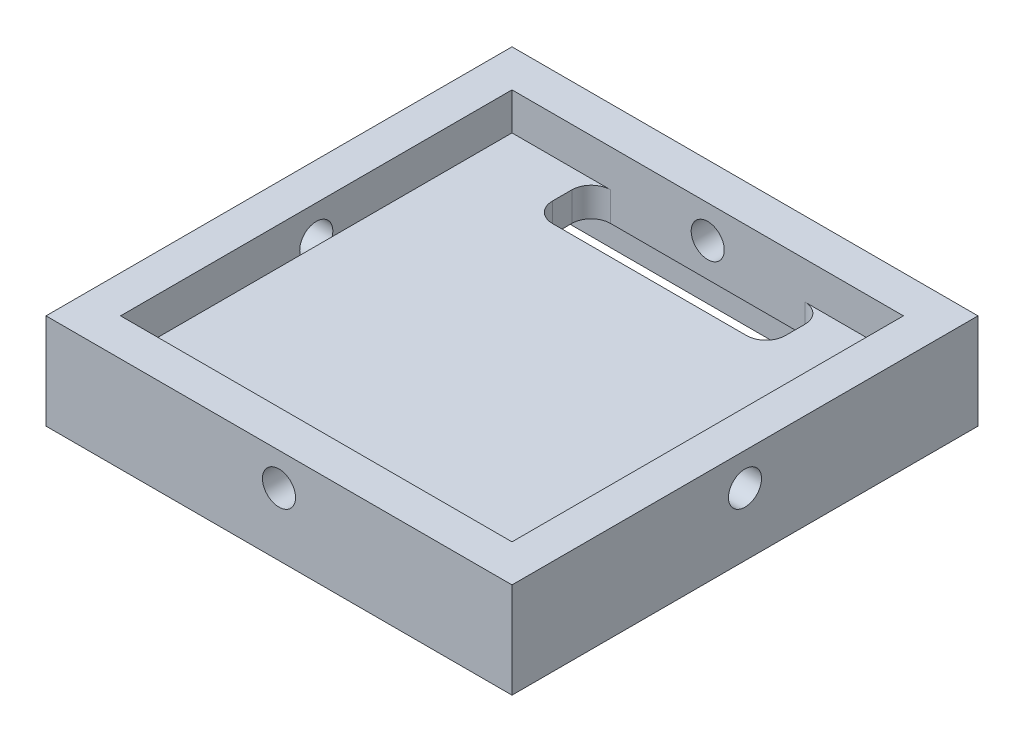
ISO-10303-21;
HEADER;
FILE_DESCRIPTION(('STEP AP214'),'2;1');
FILE_NAME('part.step','',(''),(''),'','','');
FILE_SCHEMA(('AUTOMOTIVE_DESIGN { 1 0 10303 214 1 1 1 1 }'));
ENDSEC;
DATA;
#1=APPLICATION_CONTEXT('core data for automotive mechanical design processes');
#2=APPLICATION_PROTOCOL_DEFINITION('international standard','automotive_design',2000,#1);
#3=PRODUCT_CONTEXT('',#1,'mechanical');
#4=PRODUCT('Part','Part','',(#3));
#5=PRODUCT_RELATED_PRODUCT_CATEGORY('part','',(#4));
#6=PRODUCT_DEFINITION_FORMATION('','',#4);
#7=PRODUCT_DEFINITION_CONTEXT('part definition',#1,'design');
#8=PRODUCT_DEFINITION('design','',#6,#7);
#9=PRODUCT_DEFINITION_SHAPE('','',#8);
#10=(LENGTH_UNIT() NAMED_UNIT(*) SI_UNIT(.MILLI.,.METRE.));
#11=(NAMED_UNIT(*) PLANE_ANGLE_UNIT() SI_UNIT($,.RADIAN.));
#12=(NAMED_UNIT(*) SI_UNIT($,.STERADIAN.) SOLID_ANGLE_UNIT());
#13=UNCERTAINTY_MEASURE_WITH_UNIT(LENGTH_MEASURE(1.E-05),#10,'distance_accuracy_value','');
#14=(GEOMETRIC_REPRESENTATION_CONTEXT(3) GLOBAL_UNCERTAINTY_ASSIGNED_CONTEXT((#13)) GLOBAL_UNIT_ASSIGNED_CONTEXT((#10,
#11,#12)) REPRESENTATION_CONTEXT('',''));
#15=CARTESIAN_POINT('',(0.,0.,0.));
#16=DIRECTION('',(0.,0.,1.));
#17=DIRECTION('',(1.,0.,0.));
#18=AXIS2_PLACEMENT_3D('',#15,#16,#17);
#19=CARTESIAN_POINT('',(19.05,88.9,0.));
#20=DIRECTION('',(1.,0.,0.));
#21=DIRECTION('',(0.,0.,-1.));
#22=AXIS2_PLACEMENT_3D('',#19,#20,#21);
#23=PLANE('',#22);
#24=DIRECTION('',(0.,0.,-1.));
#25=VECTOR('',#24,1.);
#26=CARTESIAN_POINT('',(19.05,88.9,-19.05));
#27=LINE('',#26,#25);
#28=CARTESIAN_POINT('',(19.05,88.9,19.05));
#29=VERTEX_POINT('',#28);
#30=CARTESIAN_POINT('',(19.05,88.9,-19.05));
#31=VERTEX_POINT('',#30);
#32=EDGE_CURVE('E264',#29,#31,#27,.T.);
#33=ORIENTED_EDGE('',*,*,#32,.T.);
#34=DIRECTION('',(0.,-1.,0.));
#35=VECTOR('',#34,1.);
#36=CARTESIAN_POINT('',(19.05,88.9,-19.05));
#37=LINE('',#36,#35);
#38=CARTESIAN_POINT('',(19.05,96.7105,-19.05));
#39=VERTEX_POINT('',#38);
#40=EDGE_CURVE('E402',#39,#31,#37,.T.);
#41=ORIENTED_EDGE('',*,*,#40,.F.);
#42=DIRECTION('',(0.,0.,-1.));
#43=VECTOR('',#42,1.);
#44=CARTESIAN_POINT('',(19.05,96.7105,19.05));
#45=LINE('',#44,#43);
#46=CARTESIAN_POINT('',(19.05,96.7105,19.05));
#47=VERTEX_POINT('',#46);
#48=EDGE_CURVE('E382',#47,#39,#45,.T.);
#49=ORIENTED_EDGE('',*,*,#48,.F.);
#50=DIRECTION('',(0.,-1.,0.));
#51=VECTOR('',#50,1.);
#52=CARTESIAN_POINT('',(19.05,88.9,19.05));
#53=LINE('',#52,#51);
#54=EDGE_CURVE('E394',#47,#29,#53,.T.);
#55=ORIENTED_EDGE('',*,*,#54,.T.);
#56=EDGE_LOOP('',(#33,#41,#49,#55));
#57=FACE_BOUND('',#56,.T.);
#58=CARTESIAN_POINT('',(19.05,94.0435,0.));
#59=DIRECTION('',(1.,0.,0.));
#60=DIRECTION('',(0.,0.,-1.));
#61=AXIS2_PLACEMENT_3D('',#58,#59,#60);
#62=CIRCLE('',#61,1.35255);
#63=CARTESIAN_POINT('',(19.05,94.0435,-1.35255));
#64=VERTEX_POINT('',#63);
#65=EDGE_CURVE('E267',#64,#64,#62,.T.);
#66=ORIENTED_EDGE('',*,*,#65,.F.);
#67=EDGE_LOOP('',(#66));
#68=FACE_BOUND('',#67,.T.);
#69=ADVANCED_FACE('F40',(#57,#68),#23,.T.);
#70=CARTESIAN_POINT('',(0.,88.9,-19.05));
#71=DIRECTION('',(0.,0.,-1.));
#72=DIRECTION('',(-1.,0.,0.));
#73=AXIS2_PLACEMENT_3D('',#70,#71,#72);
#74=PLANE('',#73);
#75=DIRECTION('',(-1.,0.,0.));
#76=VECTOR('',#75,1.);
#77=CARTESIAN_POINT('',(-19.05,88.9,-19.05));
#78=LINE('',#77,#76);
#79=CARTESIAN_POINT('',(-19.05,88.9,-19.05));
#80=VERTEX_POINT('',#79);
#81=EDGE_CURVE('E261',#31,#80,#78,.T.);
#82=ORIENTED_EDGE('',*,*,#81,.T.);
#83=DIRECTION('',(0.,-1.,0.));
#84=VECTOR('',#83,1.);
#85=CARTESIAN_POINT('',(-19.05,88.9,-19.05));
#86=LINE('',#85,#84);
#87=CARTESIAN_POINT('',(-19.05,96.7105,-19.05));
#88=VERTEX_POINT('',#87);
#89=EDGE_CURVE('E400',#88,#80,#86,.T.);
#90=ORIENTED_EDGE('',*,*,#89,.F.);
#91=DIRECTION('',(-1.,0.,0.));
#92=VECTOR('',#91,1.);
#93=CARTESIAN_POINT('',(-19.05,96.7105,-19.05));
#94=LINE('',#93,#92);
#95=EDGE_CURVE('E385',#39,#88,#94,.T.);
#96=ORIENTED_EDGE('',*,*,#95,.F.);
#97=ORIENTED_EDGE('',*,*,#40,.T.);
#98=EDGE_LOOP('',(#82,#90,#96,#97));
#99=FACE_BOUND('',#98,.T.);
#100=CARTESIAN_POINT('',(0.,94.0435,-19.05));
#101=DIRECTION('',(0.,0.,-1.));
#102=DIRECTION('',(-1.,0.,0.));
#103=AXIS2_PLACEMENT_3D('',#100,#101,#102);
#104=CIRCLE('',#103,1.35255);
#105=CARTESIAN_POINT('',(-1.35255,94.0435,-19.05));
#106=VERTEX_POINT('',#105);
#107=EDGE_CURVE('E290',#106,#106,#104,.T.);
#108=ORIENTED_EDGE('',*,*,#107,.F.);
#109=EDGE_LOOP('',(#108));
#110=FACE_BOUND('',#109,.T.);
#111=ADVANCED_FACE('F487',(#99,#110),#74,.T.);
#112=CARTESIAN_POINT('',(-19.05,88.9,0.));
#113=DIRECTION('',(1.,0.,0.));
#114=DIRECTION('',(0.,0.,-1.));
#115=AXIS2_PLACEMENT_3D('',#112,#113,#114);
#116=PLANE('',#115);
#117=ORIENTED_EDGE('',*,*,#89,.T.);
#118=DIRECTION('',(0.,0.,1.));
#119=VECTOR('',#118,1.);
#120=CARTESIAN_POINT('',(-19.05,88.9,-19.05));
#121=LINE('',#120,#119);
#122=CARTESIAN_POINT('',(-19.05,88.9,19.05));
#123=VERTEX_POINT('',#122);
#124=EDGE_CURVE('E271',#80,#123,#121,.T.);
#125=ORIENTED_EDGE('',*,*,#124,.T.);
#126=DIRECTION('',(0.,-1.,0.));
#127=VECTOR('',#126,1.);
#128=CARTESIAN_POINT('',(-19.05,88.9,19.05));
#129=LINE('',#128,#127);
#130=CARTESIAN_POINT('',(-19.05,96.7105,19.05));
#131=VERTEX_POINT('',#130);
#132=EDGE_CURVE('E397',#131,#123,#129,.T.);
#133=ORIENTED_EDGE('',*,*,#132,.F.);
#134=DIRECTION('',(0.,0.,1.));
#135=VECTOR('',#134,1.);
#136=CARTESIAN_POINT('',(-19.05,96.7105,19.05));
#137=LINE('',#136,#135);
#138=EDGE_CURVE('E388',#88,#131,#137,.T.);
#139=ORIENTED_EDGE('',*,*,#138,.F.);
#140=EDGE_LOOP('',(#117,#125,#133,#139));
#141=FACE_BOUND('',#140,.T.);
#142=CARTESIAN_POINT('',(-19.05,94.0435,0.));
#143=DIRECTION('',(-1.,0.,0.));
#144=DIRECTION('',(0.,0.,1.));
#145=AXIS2_PLACEMENT_3D('',#142,#143,#144);
#146=CIRCLE('',#145,1.35255);
#147=CARTESIAN_POINT('',(-19.05,94.0435,1.35255));
#148=VERTEX_POINT('',#147);
#149=EDGE_CURVE('E284',#148,#148,#146,.T.);
#150=ORIENTED_EDGE('',*,*,#149,.F.);
#151=EDGE_LOOP('',(#150));
#152=FACE_BOUND('',#151,.T.);
#153=ADVANCED_FACE('F493',(#141,#152),#116,.F.);
#154=CARTESIAN_POINT('',(0.,88.9,19.05));
#155=DIRECTION('',(0.,0.,-1.));
#156=DIRECTION('',(-1.,0.,0.));
#157=AXIS2_PLACEMENT_3D('',#154,#155,#156);
#158=PLANE('',#157);
#159=ORIENTED_EDGE('',*,*,#132,.T.);
#160=DIRECTION('',(1.,0.,0.));
#161=VECTOR('',#160,1.);
#162=CARTESIAN_POINT('',(-19.05,88.9,19.05));
#163=LINE('',#162,#161);
#164=EDGE_CURVE('E268',#123,#29,#163,.T.);
#165=ORIENTED_EDGE('',*,*,#164,.T.);
#166=ORIENTED_EDGE('',*,*,#54,.F.);
#167=DIRECTION('',(1.,0.,0.));
#168=VECTOR('',#167,1.);
#169=CARTESIAN_POINT('',(-19.05,96.7105,19.05));
#170=LINE('',#169,#168);
#171=EDGE_CURVE('E391',#131,#47,#170,.T.);
#172=ORIENTED_EDGE('',*,*,#171,.F.);
#173=EDGE_LOOP('',(#159,#165,#166,#172));
#174=FACE_BOUND('',#173,.T.);
#175=CARTESIAN_POINT('',(0.,94.0435,19.05));
#176=DIRECTION('',(0.,0.,1.));
#177=DIRECTION('',(1.,0.,0.));
#178=AXIS2_PLACEMENT_3D('',#175,#176,#177);
#179=CIRCLE('',#178,1.35255);
#180=CARTESIAN_POINT('',(1.35255,94.0435,19.05));
#181=VERTEX_POINT('',#180);
#182=EDGE_CURVE('E278',#181,#181,#179,.T.);
#183=ORIENTED_EDGE('',*,*,#182,.F.);
#184=EDGE_LOOP('',(#183));
#185=FACE_BOUND('',#184,.T.);
#186=ADVANCED_FACE('F539',(#174,#185),#158,.F.);
#187=CARTESIAN_POINT('',(0.,96.7105,0.));
#188=DIRECTION('',(0.,-1.,0.));
#189=DIRECTION('',(0.,0.,-1.));
#190=AXIS2_PLACEMENT_3D('',#187,#188,#189);
#191=PLANE('',#190);
#192=ORIENTED_EDGE('',*,*,#48,.T.);
#193=ORIENTED_EDGE('',*,*,#95,.T.);
#194=ORIENTED_EDGE('',*,*,#138,.T.);
#195=ORIENTED_EDGE('',*,*,#171,.T.);
#196=EDGE_LOOP('',(#192,#193,#194,#195));
#197=FACE_BOUND('',#196,.T.);
#198=DIRECTION('',(0.,0.,-1.));
#199=VECTOR('',#198,1.);
#200=CARTESIAN_POINT('',(16.002,96.7105,16.002));
#201=LINE('',#200,#199);
#202=CARTESIAN_POINT('',(16.002,96.7105,16.002));
#203=VERTEX_POINT('',#202);
#204=CARTESIAN_POINT('',(16.002,96.7105,-16.002));
#205=VERTEX_POINT('',#204);
#206=EDGE_CURVE('E369',#203,#205,#201,.T.);
#207=ORIENTED_EDGE('',*,*,#206,.F.);
#208=DIRECTION('',(1.,0.,0.));
#209=VECTOR('',#208,1.);
#210=CARTESIAN_POINT('',(-16.002,96.7105,16.002));
#211=LINE('',#210,#209);
#212=CARTESIAN_POINT('',(-16.002,96.7105,16.002));
#213=VERTEX_POINT('',#212);
#214=EDGE_CURVE('E375',#213,#203,#211,.T.);
#215=ORIENTED_EDGE('',*,*,#214,.F.);
#216=DIRECTION('',(0.,0.,1.));
#217=VECTOR('',#216,1.);
#218=CARTESIAN_POINT('',(-16.002,96.7105,16.002));
#219=LINE('',#218,#217);
#220=CARTESIAN_POINT('',(-16.002,96.7105,-16.002));
#221=VERTEX_POINT('',#220);
#222=EDGE_CURVE('E451',#221,#213,#219,.T.);
#223=ORIENTED_EDGE('',*,*,#222,.F.);
#224=DIRECTION('',(-1.,0.,0.));
#225=VECTOR('',#224,1.);
#226=CARTESIAN_POINT('',(-16.002,96.7105,-16.002));
#227=LINE('',#226,#225);
#228=EDGE_CURVE('E445',#205,#221,#227,.T.);
#229=ORIENTED_EDGE('',*,*,#228,.F.);
#230=EDGE_LOOP('',(#207,#215,#223,#229));
#231=FACE_BOUND('',#230,.T.);
#232=ADVANCED_FACE('F448',(#197,#231),#191,.F.);
#233=CARTESIAN_POINT('',(16.002,96.7105,16.002));
#234=DIRECTION('',(-1.,0.,0.));
#235=DIRECTION('',(0.,0.,1.));
#236=AXIS2_PLACEMENT_3D('',#233,#234,#235);
#237=PLANE('',#236);
#238=CARTESIAN_POINT('',(16.002,94.0435,0.));
#239=DIRECTION('',(1.,0.,0.));
#240=DIRECTION('',(0.,0.,-1.));
#241=AXIS2_PLACEMENT_3D('',#238,#239,#240);
#242=CIRCLE('',#241,1.35255);
#243=CARTESIAN_POINT('',(16.002,93.6625,-1.29777906536514));
#244=VERTEX_POINT('',#243);
#245=CARTESIAN_POINT('',(16.002,93.6625,1.29777906536514));
#246=VERTEX_POINT('',#245);
#247=EDGE_CURVE('E279',#244,#246,#242,.T.);
#248=ORIENTED_EDGE('',*,*,#247,.T.);
#249=DIRECTION('',(0.,0.,-1.));
#250=VECTOR('',#249,1.);
#251=CARTESIAN_POINT('',(16.002,93.6625,16.002));
#252=LINE('',#251,#250);
#253=CARTESIAN_POINT('',(16.002,93.6625,16.002));
#254=VERTEX_POINT('',#253);
#255=EDGE_CURVE('E344',#254,#246,#252,.T.);
#256=ORIENTED_EDGE('',*,*,#255,.F.);
#257=DIRECTION('',(0.,-1.,0.));
#258=VECTOR('',#257,1.);
#259=CARTESIAN_POINT('',(16.002,96.7105,16.002));
#260=LINE('',#259,#258);
#261=EDGE_CURVE('E371',#203,#254,#260,.T.);
#262=ORIENTED_EDGE('',*,*,#261,.F.);
#263=ORIENTED_EDGE('',*,*,#206,.T.);
#264=DIRECTION('',(0.,-1.,0.));
#265=VECTOR('',#264,1.);
#266=CARTESIAN_POINT('',(16.002,96.7105,-16.002));
#267=LINE('',#266,#265);
#268=CARTESIAN_POINT('',(16.002,93.6625,-16.002));
#269=VERTEX_POINT('',#268);
#270=EDGE_CURVE('E379',#205,#269,#267,.T.);
#271=ORIENTED_EDGE('',*,*,#270,.T.);
#272=EDGE_CURVE('E352',#244,#269,#252,.T.);
#273=ORIENTED_EDGE('',*,*,#272,.F.);
#274=EDGE_LOOP('',(#248,#256,#262,#263,#271,#273));
#275=FACE_BOUND('',#274,.T.);
#276=ADVANCED_FACE('F439',(#275),#237,.T.);
#277=CARTESIAN_POINT('',(-16.002,96.7105,-16.002));
#278=DIRECTION('',(0.,0.,1.));
#279=DIRECTION('',(1.,0.,0.));
#280=AXIS2_PLACEMENT_3D('',#277,#278,#279);
#281=PLANE('',#280);
#282=DIRECTION('',(-1.,0.,0.));
#283=VECTOR('',#282,1.);
#284=CARTESIAN_POINT('',(-16.002,91.28125,-16.002));
#285=LINE('',#284,#283);
#286=CARTESIAN_POINT('',(7.9375,91.28125,-16.002));
#287=VERTEX_POINT('',#286);
#288=CARTESIAN_POINT('',(-7.9375,91.28125,-16.002));
#289=VERTEX_POINT('',#288);
#290=EDGE_CURVE('E63',#287,#289,#285,.T.);
#291=ORIENTED_EDGE('',*,*,#290,.F.);
#292=DIRECTION('',(0.,1.,0.));
#293=VECTOR('',#292,1.);
#294=CARTESIAN_POINT('',(7.9375,96.7105,-16.002));
#295=LINE('',#294,#293);
#296=CARTESIAN_POINT('',(7.9375,93.6625,-16.002));
#297=VERTEX_POINT('',#296);
#298=EDGE_CURVE('E318',#287,#297,#295,.T.);
#299=ORIENTED_EDGE('',*,*,#298,.T.);
#300=DIRECTION('',(-1.,0.,0.));
#301=VECTOR('',#300,1.);
#302=CARTESIAN_POINT('',(-16.002,93.6625,-16.002));
#303=LINE('',#302,#301);
#304=EDGE_CURVE('E343',#269,#297,#303,.T.);
#305=ORIENTED_EDGE('',*,*,#304,.F.);
#306=ORIENTED_EDGE('',*,*,#270,.F.);
#307=ORIENTED_EDGE('',*,*,#228,.T.);
#308=DIRECTION('',(0.,-1.,0.));
#309=VECTOR('',#308,1.);
#310=CARTESIAN_POINT('',(-16.002,96.7105,-16.002));
#311=LINE('',#310,#309);
#312=CARTESIAN_POINT('',(-16.002,93.6625,-16.002));
#313=VERTEX_POINT('',#312);
#314=EDGE_CURVE('E341',#221,#313,#311,.T.);
#315=ORIENTED_EDGE('',*,*,#314,.T.);
#316=CARTESIAN_POINT('',(-7.9375,93.6625,-16.002));
#317=VERTEX_POINT('',#316);
#318=EDGE_CURVE('E332',#317,#313,#303,.T.);
#319=ORIENTED_EDGE('',*,*,#318,.F.);
#320=DIRECTION('',(0.,1.,0.));
#321=VECTOR('',#320,1.);
#322=CARTESIAN_POINT('',(-7.9375,96.7105,-16.002));
#323=LINE('',#322,#321);
#324=EDGE_CURVE('E315',#317,#289,#323,.F.);
#325=ORIENTED_EDGE('',*,*,#324,.T.);
#326=EDGE_LOOP('',(#291,#299,#305,#306,#307,#315,#319,#325));
#327=FACE_BOUND('',#326,.T.);
#328=CARTESIAN_POINT('',(0.,94.0435,-16.002));
#329=DIRECTION('',(0.,0.,-1.));
#330=DIRECTION('',(-1.,0.,0.));
#331=AXIS2_PLACEMENT_3D('',#328,#329,#330);
#332=CIRCLE('',#331,1.35255);
#333=CARTESIAN_POINT('',(-1.35255,94.0435,-16.002));
#334=VERTEX_POINT('',#333);
#335=EDGE_CURVE('E294',#334,#334,#332,.T.);
#336=ORIENTED_EDGE('',*,*,#335,.T.);
#337=EDGE_LOOP('',(#336));
#338=FACE_BOUND('',#337,.T.);
#339=ADVANCED_FACE('F337',(#327,#338),#281,.T.);
#340=CARTESIAN_POINT('',(-16.002,96.7105,16.002));
#341=DIRECTION('',(1.,0.,0.));
#342=DIRECTION('',(0.,0.,-1.));
#343=AXIS2_PLACEMENT_3D('',#340,#341,#342);
#344=PLANE('',#343);
#345=CARTESIAN_POINT('',(-16.002,94.0435,0.));
#346=DIRECTION('',(-1.,0.,0.));
#347=DIRECTION('',(0.,0.,1.));
#348=AXIS2_PLACEMENT_3D('',#345,#346,#347);
#349=CIRCLE('',#348,1.35255);
#350=CARTESIAN_POINT('',(-16.002,93.6625,1.29777906536514));
#351=VERTEX_POINT('',#350);
#352=CARTESIAN_POINT('',(-16.002,93.6625,-1.29777906536514));
#353=VERTEX_POINT('',#352);
#354=EDGE_CURVE('E291',#351,#353,#349,.T.);
#355=ORIENTED_EDGE('',*,*,#354,.T.);
#356=DIRECTION('',(0.,0.,1.));
#357=VECTOR('',#356,1.);
#358=CARTESIAN_POINT('',(-16.002,93.6625,16.002));
#359=LINE('',#358,#357);
#360=EDGE_CURVE('E361',#313,#353,#359,.T.);
#361=ORIENTED_EDGE('',*,*,#360,.F.);
#362=ORIENTED_EDGE('',*,*,#314,.F.);
#363=ORIENTED_EDGE('',*,*,#222,.T.);
#364=DIRECTION('',(0.,-1.,0.));
#365=VECTOR('',#364,1.);
#366=CARTESIAN_POINT('',(-16.002,96.7105,16.002));
#367=LINE('',#366,#365);
#368=CARTESIAN_POINT('',(-16.002,93.6625,16.002));
#369=VERTEX_POINT('',#368);
#370=EDGE_CURVE('E374',#213,#369,#367,.T.);
#371=ORIENTED_EDGE('',*,*,#370,.T.);
#372=EDGE_CURVE('E347',#351,#369,#359,.T.);
#373=ORIENTED_EDGE('',*,*,#372,.F.);
#374=EDGE_LOOP('',(#355,#361,#362,#363,#371,#373));
#375=FACE_BOUND('',#374,.T.);
#376=ADVANCED_FACE('F467',(#375),#344,.T.);
#377=CARTESIAN_POINT('',(-16.002,96.7105,16.002));
#378=DIRECTION('',(0.,0.,-1.));
#379=DIRECTION('',(-1.,0.,0.));
#380=AXIS2_PLACEMENT_3D('',#377,#378,#379);
#381=PLANE('',#380);
#382=CARTESIAN_POINT('',(0.,94.0435,16.002));
#383=DIRECTION('',(0.,0.,1.));
#384=DIRECTION('',(1.,0.,0.));
#385=AXIS2_PLACEMENT_3D('',#382,#383,#384);
#386=CIRCLE('',#385,1.35255);
#387=CARTESIAN_POINT('',(1.29777906536514,93.6625,16.002));
#388=VERTEX_POINT('',#387);
#389=CARTESIAN_POINT('',(-1.29777906536514,93.6625,16.002));
#390=VERTEX_POINT('',#389);
#391=EDGE_CURVE('E285',#388,#390,#386,.T.);
#392=ORIENTED_EDGE('',*,*,#391,.T.);
#393=DIRECTION('',(1.,0.,0.));
#394=VECTOR('',#393,1.);
#395=CARTESIAN_POINT('',(-16.002,93.6625,16.002));
#396=LINE('',#395,#394);
#397=EDGE_CURVE('E366',#369,#390,#396,.T.);
#398=ORIENTED_EDGE('',*,*,#397,.F.);
#399=ORIENTED_EDGE('',*,*,#370,.F.);
#400=ORIENTED_EDGE('',*,*,#214,.T.);
#401=ORIENTED_EDGE('',*,*,#261,.T.);
#402=EDGE_CURVE('E364',#388,#254,#396,.T.);
#403=ORIENTED_EDGE('',*,*,#402,.F.);
#404=EDGE_LOOP('',(#392,#398,#399,#400,#401,#403));
#405=FACE_BOUND('',#404,.T.);
#406=ADVANCED_FACE('F456',(#405),#381,.T.);
#407=CARTESIAN_POINT('',(0.,93.6625,0.));
#408=DIRECTION('',(0.,1.,0.));
#409=DIRECTION('',(0.,0.,1.));
#410=AXIS2_PLACEMENT_3D('',#407,#408,#409);
#411=PLANE('',#410);
#412=DIRECTION('',(0.,0.,1.));
#413=VECTOR('',#412,1.);
#414=CARTESIAN_POINT('',(-9.525,93.6625,-11.2395));
#415=LINE('',#414,#413);
#416=CARTESIAN_POINT('',(-9.525,93.6625,-14.4145));
#417=VERTEX_POINT('',#416);
#418=CARTESIAN_POINT('',(-9.525,93.6625,-12.827));
#419=VERTEX_POINT('',#418);
#420=EDGE_CURVE('E297',#417,#419,#415,.T.);
#421=ORIENTED_EDGE('',*,*,#420,.F.);
#422=CARTESIAN_POINT('',(-7.9375,93.6625,-14.4145));
#423=DIRECTION('',(0.,1.,0.));
#424=DIRECTION('',(0.,0.,1.));
#425=AXIS2_PLACEMENT_3D('',#422,#423,#424);
#426=CIRCLE('',#425,1.5875);
#427=EDGE_CURVE('E48',#417,#317,#426,.F.);
#428=ORIENTED_EDGE('',*,*,#427,.T.);
#429=ORIENTED_EDGE('',*,*,#318,.T.);
#430=ORIENTED_EDGE('',*,*,#360,.T.);
#431=EDGE_CURVE('E365',#353,#351,#359,.T.);
#432=ORIENTED_EDGE('',*,*,#431,.T.);
#433=ORIENTED_EDGE('',*,*,#372,.T.);
#434=ORIENTED_EDGE('',*,*,#397,.T.);
#435=EDGE_CURVE('E370',#390,#388,#396,.T.);
#436=ORIENTED_EDGE('',*,*,#435,.T.);
#437=ORIENTED_EDGE('',*,*,#402,.T.);
#438=ORIENTED_EDGE('',*,*,#255,.T.);
#439=EDGE_CURVE('E350',#246,#244,#252,.T.);
#440=ORIENTED_EDGE('',*,*,#439,.T.);
#441=ORIENTED_EDGE('',*,*,#272,.T.);
#442=ORIENTED_EDGE('',*,*,#304,.T.);
#443=CARTESIAN_POINT('',(7.9375,93.6625,-14.4145));
#444=DIRECTION('',(0.,1.,0.));
#445=DIRECTION('',(0.,0.,1.));
#446=AXIS2_PLACEMENT_3D('',#443,#444,#445);
#447=CIRCLE('',#446,1.5875);
#448=CARTESIAN_POINT('',(9.525,93.6625,-14.4145));
#449=VERTEX_POINT('',#448);
#450=EDGE_CURVE('E324',#297,#449,#447,.F.);
#451=ORIENTED_EDGE('',*,*,#450,.T.);
#452=DIRECTION('',(0.,0.,-1.));
#453=VECTOR('',#452,1.);
#454=CARTESIAN_POINT('',(9.525,93.6625,-11.2395));
#455=LINE('',#454,#453);
#456=CARTESIAN_POINT('',(9.525,93.6625,-12.827));
#457=VERTEX_POINT('',#456);
#458=EDGE_CURVE('E415',#457,#449,#455,.T.);
#459=ORIENTED_EDGE('',*,*,#458,.F.);
#460=CARTESIAN_POINT('',(7.9375,93.6625,-12.827));
#461=DIRECTION('',(0.,1.,0.));
#462=DIRECTION('',(0.,0.,1.));
#463=AXIS2_PLACEMENT_3D('',#460,#461,#462);
#464=CIRCLE('',#463,1.5875);
#465=CARTESIAN_POINT('',(7.9375,93.6625,-11.2395));
#466=VERTEX_POINT('',#465);
#467=EDGE_CURVE('E320',#457,#466,#464,.F.);
#468=ORIENTED_EDGE('',*,*,#467,.T.);
#469=DIRECTION('',(1.,0.,0.));
#470=VECTOR('',#469,1.);
#471=CARTESIAN_POINT('',(9.525,93.6625,-11.2395));
#472=LINE('',#471,#470);
#473=CARTESIAN_POINT('',(-7.93749999999999,93.6625,-11.2395));
#474=VERTEX_POINT('',#473);
#475=EDGE_CURVE('E302',#474,#466,#472,.T.);
#476=ORIENTED_EDGE('',*,*,#475,.F.);
#477=CARTESIAN_POINT('',(-7.9375,93.6625,-12.827));
#478=DIRECTION('',(0.,1.,0.));
#479=DIRECTION('',(0.,0.,1.));
#480=AXIS2_PLACEMENT_3D('',#477,#478,#479);
#481=CIRCLE('',#480,1.5875);
#482=EDGE_CURVE('E322',#474,#419,#481,.F.);
#483=ORIENTED_EDGE('',*,*,#482,.T.);
#484=EDGE_LOOP('',(#421,#428,#429,#430,#432,#433,#434,#436,#437,#438,#440,#441,#442,#451,#459,
#468,#476,#483));
#485=FACE_BOUND('',#484,.T.);
#486=ADVANCED_FACE('F330',(#485),#411,.T.);
#487=CARTESIAN_POINT('',(0.,88.9,0.));
#488=DIRECTION('',(0.,1.,0.));
#489=DIRECTION('',(0.,0.,1.));
#490=AXIS2_PLACEMENT_3D('',#487,#488,#489);
#491=PLANE('',#490);
#492=DIRECTION('',(-1.,0.,0.));
#493=VECTOR('',#492,1.);
#494=CARTESIAN_POINT('',(-16.66875,88.9,16.66875));
#495=LINE('',#494,#493);
#496=CARTESIAN_POINT('',(16.66875,88.9,16.66875));
#497=VERTEX_POINT('',#496);
#498=CARTESIAN_POINT('',(-16.66875,88.9,16.66875));
#499=VERTEX_POINT('',#498);
#500=EDGE_CURVE('E223',#497,#499,#495,.T.);
#501=ORIENTED_EDGE('',*,*,#500,.F.);
#502=DIRECTION('',(0.,0.,1.));
#503=VECTOR('',#502,1.);
#504=CARTESIAN_POINT('',(16.66875,88.9,-16.66875));
#505=LINE('',#504,#503);
#506=CARTESIAN_POINT('',(16.66875,88.9,-16.66875));
#507=VERTEX_POINT('',#506);
#508=EDGE_CURVE('E55',#507,#497,#505,.T.);
#509=ORIENTED_EDGE('',*,*,#508,.F.);
#510=DIRECTION('',(1.,0.,0.));
#511=VECTOR('',#510,1.);
#512=CARTESIAN_POINT('',(-16.66875,88.9,-16.66875));
#513=LINE('',#512,#511);
#514=CARTESIAN_POINT('',(-16.66875,88.9,-16.66875));
#515=VERTEX_POINT('',#514);
#516=EDGE_CURVE('E214',#515,#507,#513,.T.);
#517=ORIENTED_EDGE('',*,*,#516,.F.);
#518=DIRECTION('',(0.,0.,-1.));
#519=VECTOR('',#518,1.);
#520=CARTESIAN_POINT('',(-16.66875,88.9,-16.66875));
#521=LINE('',#520,#519);
#522=EDGE_CURVE('E217',#499,#515,#521,.T.);
#523=ORIENTED_EDGE('',*,*,#522,.F.);
#524=EDGE_LOOP('',(#501,#509,#517,#523));
#525=FACE_BOUND('',#524,.T.);
#526=CARTESIAN_POINT('',(0.,88.9,-17.859375));
#527=DIRECTION('',(0.,-1.,0.));
#528=DIRECTION('',(0.,0.,-1.));
#529=AXIS2_PLACEMENT_3D('',#526,#527,#528);
#530=CIRCLE('',#529,0.69453125);
#531=CARTESIAN_POINT('',(0.,88.9,-18.55390625));
#532=VERTEX_POINT('',#531);
#533=EDGE_CURVE('E251',#532,#532,#530,.T.);
#534=ORIENTED_EDGE('',*,*,#533,.F.);
#535=EDGE_LOOP('',(#534));
#536=FACE_BOUND('',#535,.T.);
#537=CARTESIAN_POINT('',(0.,88.9,17.859375));
#538=DIRECTION('',(0.,-1.,0.));
#539=DIRECTION('',(0.,0.,-1.));
#540=AXIS2_PLACEMENT_3D('',#537,#538,#539);
#541=CIRCLE('',#540,0.69453125);
#542=CARTESIAN_POINT('',(0.,88.9,17.16484375));
#543=VERTEX_POINT('',#542);
#544=EDGE_CURVE('E255',#543,#543,#541,.T.);
#545=ORIENTED_EDGE('',*,*,#544,.F.);
#546=EDGE_LOOP('',(#545));
#547=FACE_BOUND('',#546,.T.);
#548=ORIENTED_EDGE('',*,*,#81,.F.);
#549=ORIENTED_EDGE('',*,*,#32,.F.);
#550=ORIENTED_EDGE('',*,*,#164,.F.);
#551=ORIENTED_EDGE('',*,*,#124,.F.);
#552=EDGE_LOOP('',(#548,#549,#550,#551));
#553=FACE_BOUND('',#552,.T.);
#554=ADVANCED_FACE('F551',(#525,#536,#547,#553),#491,.F.);
#555=CARTESIAN_POINT('',(-9.525,-1.31770749369318,-11.2395));
#556=DIRECTION('',(-1.,0.,0.));
#557=DIRECTION('',(0.,0.,1.));
#558=AXIS2_PLACEMENT_3D('',#555,#556,#557);
#559=PLANE('',#558);
#560=DIRECTION('',(0.,1.,0.));
#561=VECTOR('',#560,1.);
#562=CARTESIAN_POINT('',(-9.525,88.9,-12.827));
#563=LINE('',#562,#561);
#564=CARTESIAN_POINT('',(-9.525,91.28125,-12.827));
#565=VERTEX_POINT('',#564);
#566=EDGE_CURVE('E312',#419,#565,#563,.F.);
#567=ORIENTED_EDGE('',*,*,#566,.T.);
#568=DIRECTION('',(0.,0.,-1.));
#569=VECTOR('',#568,1.);
#570=CARTESIAN_POINT('',(-9.525,91.28125,-11.2395));
#571=LINE('',#570,#569);
#572=CARTESIAN_POINT('',(-9.525,91.28125,-14.4145));
#573=VERTEX_POINT('',#572);
#574=EDGE_CURVE('E229',#565,#573,#571,.T.);
#575=ORIENTED_EDGE('',*,*,#574,.T.);
#576=DIRECTION('',(0.,1.,0.));
#577=VECTOR('',#576,1.);
#578=CARTESIAN_POINT('',(-9.525,-1.31770749369318,-14.4145));
#579=LINE('',#578,#577);
#580=EDGE_CURVE('E310',#573,#417,#579,.T.);
#581=ORIENTED_EDGE('',*,*,#580,.T.);
#582=ORIENTED_EDGE('',*,*,#420,.T.);
#583=EDGE_LOOP('',(#567,#575,#581,#582));
#584=FACE_BOUND('',#583,.T.);
#585=ADVANCED_FACE('F554',(#584),#559,.F.);
#586=CARTESIAN_POINT('',(9.525,-1.31770749369318,-11.2395));
#587=DIRECTION('',(1.,0.,0.));
#588=DIRECTION('',(0.,0.,-1.));
#589=AXIS2_PLACEMENT_3D('',#586,#587,#588);
#590=PLANE('',#589);
#591=DIRECTION('',(0.,1.,0.));
#592=VECTOR('',#591,1.);
#593=CARTESIAN_POINT('',(9.525,-1.31770749369318,-14.4145));
#594=LINE('',#593,#592);
#595=CARTESIAN_POINT('',(9.525,91.28125,-14.4145));
#596=VERTEX_POINT('',#595);
#597=EDGE_CURVE('E404',#449,#596,#594,.F.);
#598=ORIENTED_EDGE('',*,*,#597,.T.);
#599=DIRECTION('',(0.,0.,1.));
#600=VECTOR('',#599,1.);
#601=CARTESIAN_POINT('',(9.525,91.28125,-11.2395));
#602=LINE('',#601,#600);
#603=CARTESIAN_POINT('',(9.525,91.28125,-12.827));
#604=VERTEX_POINT('',#603);
#605=EDGE_CURVE('E245',#596,#604,#602,.T.);
#606=ORIENTED_EDGE('',*,*,#605,.T.);
#607=DIRECTION('',(0.,1.,0.));
#608=VECTOR('',#607,1.);
#609=CARTESIAN_POINT('',(9.525,93.6625,-12.827));
#610=LINE('',#609,#608);
#611=EDGE_CURVE('E408',#604,#457,#610,.T.);
#612=ORIENTED_EDGE('',*,*,#611,.T.);
#613=ORIENTED_EDGE('',*,*,#458,.T.);
#614=EDGE_LOOP('',(#598,#606,#612,#613));
#615=FACE_BOUND('',#614,.T.);
#616=ADVANCED_FACE('F429',(#615),#590,.F.);
#617=CARTESIAN_POINT('',(9.525,-1.31770749369318,-11.2395));
#618=DIRECTION('',(0.,0.,1.));
#619=DIRECTION('',(1.,0.,0.));
#620=AXIS2_PLACEMENT_3D('',#617,#618,#619);
#621=PLANE('',#620);
#622=DIRECTION('',(0.,1.,0.));
#623=VECTOR('',#622,1.);
#624=CARTESIAN_POINT('',(7.9375,88.9,-11.2395));
#625=LINE('',#624,#623);
#626=CARTESIAN_POINT('',(7.9375,91.28125,-11.2395));
#627=VERTEX_POINT('',#626);
#628=EDGE_CURVE('E308',#466,#627,#625,.F.);
#629=ORIENTED_EDGE('',*,*,#628,.T.);
#630=DIRECTION('',(-1.,0.,0.));
#631=VECTOR('',#630,1.);
#632=CARTESIAN_POINT('',(9.525,91.28125,-11.2395));
#633=LINE('',#632,#631);
#634=CARTESIAN_POINT('',(-7.9375,91.28125,-11.2395));
#635=VERTEX_POINT('',#634);
#636=EDGE_CURVE('E242',#627,#635,#633,.T.);
#637=ORIENTED_EDGE('',*,*,#636,.T.);
#638=DIRECTION('',(0.,1.,0.));
#639=VECTOR('',#638,1.);
#640=CARTESIAN_POINT('',(-7.9375,93.6625,-11.2395));
#641=LINE('',#640,#639);
#642=EDGE_CURVE('E413',#635,#474,#641,.T.);
#643=ORIENTED_EDGE('',*,*,#642,.T.);
#644=ORIENTED_EDGE('',*,*,#475,.T.);
#645=EDGE_LOOP('',(#629,#637,#643,#644));
#646=FACE_BOUND('',#645,.T.);
#647=ADVANCED_FACE('F422',(#646),#621,.F.);
#648=CARTESIAN_POINT('',(0.,94.0435,-16.002));
#649=DIRECTION('',(0.,0.,-1.));
#650=DIRECTION('',(-1.,0.,0.));
#651=AXIS2_PLACEMENT_3D('',#648,#649,#650);
#652=CYLINDRICAL_SURFACE('',#651,1.35255);
#653=CARTESIAN_POINT('',(-1.35255,94.0435,-16.002));
#654=CARTESIAN_POINT('',(-1.35255,94.0435,-16.03375));
#655=CARTESIAN_POINT('',(-1.35255,94.0435,-16.0655));
#656=CARTESIAN_POINT('',(-1.35255,94.0435,-16.129));
#657=CARTESIAN_POINT('',(-1.35255,94.0435,-16.16075));
#658=CARTESIAN_POINT('',(-1.35255,94.0435,-16.22425));
#659=CARTESIAN_POINT('',(-1.35255,94.0435,-16.256));
#660=CARTESIAN_POINT('',(-1.35255,94.0435,-16.3195));
#661=CARTESIAN_POINT('',(-1.35255,94.0435,-16.35125));
#662=CARTESIAN_POINT('',(-1.35255,94.0435,-16.41475));
#663=CARTESIAN_POINT('',(-1.35255,94.0435,-16.4465));
#664=CARTESIAN_POINT('',(-1.35255,94.0435,-16.51));
#665=CARTESIAN_POINT('',(-1.35255,94.0435,-16.54175));
#666=CARTESIAN_POINT('',(-1.35255,94.0435,-16.60525));
#667=CARTESIAN_POINT('',(-1.35255,94.0435,-16.637));
#668=CARTESIAN_POINT('',(-1.35255,94.0435,-16.7005));
#669=CARTESIAN_POINT('',(-1.35255,94.0435,-16.73225));
#670=CARTESIAN_POINT('',(-1.35255,94.0435,-16.79575));
#671=CARTESIAN_POINT('',(-1.35255,94.0435,-16.8275));
#672=CARTESIAN_POINT('',(-1.35255,94.0435,-16.891));
#673=CARTESIAN_POINT('',(-1.35255,94.0435,-16.92275));
#674=CARTESIAN_POINT('',(-1.35255,94.0435,-16.98625));
#675=CARTESIAN_POINT('',(-1.35255,94.0435,-17.018));
#676=CARTESIAN_POINT('',(-1.35255,94.0435,-17.0815));
#677=CARTESIAN_POINT('',(-1.35255,94.0435,-17.11325));
#678=CARTESIAN_POINT('',(-1.35255,94.0435,-17.17675));
#679=CARTESIAN_POINT('',(-1.35255,94.0435,-17.2085));
#680=CARTESIAN_POINT('',(-1.35255,94.0435,-17.272));
#681=CARTESIAN_POINT('',(-1.35255,94.0435,-17.30375));
#682=CARTESIAN_POINT('',(-1.35255,94.0435,-17.36725));
#683=CARTESIAN_POINT('',(-1.35255,94.0435,-17.399));
#684=CARTESIAN_POINT('',(-1.35255,94.0435,-17.4625));
#685=CARTESIAN_POINT('',(-1.35255,94.0435,-17.49425));
#686=CARTESIAN_POINT('',(-1.35255,94.0435,-17.55775));
#687=CARTESIAN_POINT('',(-1.35255,94.0435,-17.5895));
#688=CARTESIAN_POINT('',(-1.35255,94.0435,-17.653));
#689=CARTESIAN_POINT('',(-1.35255,94.0435,-17.68475));
#690=CARTESIAN_POINT('',(-1.35255,94.0435,-17.74825));
#691=CARTESIAN_POINT('',(-1.35255,94.0435,-17.78));
#692=CARTESIAN_POINT('',(-1.35255,94.0435,-17.8435));
#693=CARTESIAN_POINT('',(-1.35255,94.0435,-17.87525));
#694=CARTESIAN_POINT('',(-1.35255,94.0435,-17.93875));
#695=CARTESIAN_POINT('',(-1.35255,94.0435,-17.9705));
#696=CARTESIAN_POINT('',(-1.35255,94.0435,-18.034));
#697=CARTESIAN_POINT('',(-1.35255,94.0435,-18.06575));
#698=CARTESIAN_POINT('',(-1.35255,94.0435,-18.12925));
#699=CARTESIAN_POINT('',(-1.35255,94.0435,-18.161));
#700=CARTESIAN_POINT('',(-1.35255,94.0435,-18.2245));
#701=CARTESIAN_POINT('',(-1.35255,94.0435,-18.25625));
#702=CARTESIAN_POINT('',(-1.35255,94.0435,-18.31975));
#703=CARTESIAN_POINT('',(-1.35255,94.0435,-18.3515));
#704=CARTESIAN_POINT('',(-1.35255,94.0435,-18.415));
#705=CARTESIAN_POINT('',(-1.35255,94.0435,-18.44675));
#706=CARTESIAN_POINT('',(-1.35255,94.0435,-18.51025));
#707=CARTESIAN_POINT('',(-1.35255,94.0435,-18.542));
#708=CARTESIAN_POINT('',(-1.35255,94.0435,-18.6055));
#709=CARTESIAN_POINT('',(-1.35255,94.0435,-18.63725));
#710=CARTESIAN_POINT('',(-1.35255,94.0435,-18.70075));
#711=CARTESIAN_POINT('',(-1.35255,94.0435,-18.7325));
#712=CARTESIAN_POINT('',(-1.35255,94.0435,-18.796));
#713=CARTESIAN_POINT('',(-1.35255,94.0435,-18.82775));
#714=CARTESIAN_POINT('',(-1.35255,94.0435,-18.89125));
#715=CARTESIAN_POINT('',(-1.35255,94.0435,-18.923));
#716=CARTESIAN_POINT('',(-1.35255,94.0435,-18.9865));
#717=CARTESIAN_POINT('',(-1.35255,94.0435,-19.01825));
#718=CARTESIAN_POINT('',(-1.35255,94.0435,-19.05));
#719=B_SPLINE_CURVE_WITH_KNOTS('',3,(#653,#654,#655,#656,#657,#658,#659,#660,#661,#662,#663,
#664,#665,#666,#667,#668,#669,#670,#671,#672,#673,#674,#675,#676,#677,#678,#679,#680,#681,#682,
#683,#684,#685,#686,#687,#688,#689,#690,#691,#692,#693,#694,#695,#696,#697,#698,#699,#700,#701,
#702,#703,#704,#705,#706,#707,#708,#709,#710,#711,#712,#713,#714,#715,#716,#717,#718),
.UNSPECIFIED.,.F.,.F.,(4,2,2,2,2,2,2,2,2,2,2,2,2,2,2,2,2,2,2,2,2,2,2,2,2,2,2,2,2,2,2,2,4),(0.,
0.0952499999999981,0.1905,0.285749999999998,0.380999999999999,0.476249999999998,
0.571499999999999,0.666749999999997,0.761999999999999,0.857249999999997,0.952499999999998,
1.04775,1.143,1.23825,1.3335,1.42875,1.524,1.61925,1.7145,1.80975,1.905,2.00025,2.0955,2.19075,
2.286,2.38125,2.4765,2.57175,2.667,2.76225,2.8575,2.95275,3.048),.UNSPECIFIED.);
#720=EDGE_CURVE('BSEAM484',#334,#106,#719,.T.);
#721=ORIENTED_EDGE('',*,*,#335,.F.);
#722=ORIENTED_EDGE('',*,*,#107,.T.);
#723=ORIENTED_EDGE('',*,*,#720,.T.);
#724=ORIENTED_EDGE('',*,*,#720,.F.);
#725=EDGE_LOOP('',(#721,#723,#722,#724));
#726=FACE_BOUND('',#725,.T.);
#727=ADVANCED_FACE('F484',(#726),#652,.F.);
#728=CARTESIAN_POINT('',(-16.002,94.0435,0.));
#729=DIRECTION('',(-1.,0.,0.));
#730=DIRECTION('',(0.,0.,1.));
#731=AXIS2_PLACEMENT_3D('',#728,#729,#730);
#732=CYLINDRICAL_SURFACE('',#731,1.35255);
#733=EDGE_CURVE('E288',#353,#351,#349,.T.);
#734=ORIENTED_EDGE('',*,*,#733,.F.);
#735=ORIENTED_EDGE('',*,*,#354,.F.);
#736=EDGE_LOOP('',(#734,#735));
#737=FACE_BOUND('',#736,.T.);
#738=ORIENTED_EDGE('',*,*,#149,.T.);
#739=EDGE_LOOP('',(#738));
#740=FACE_BOUND('',#739,.T.);
#741=ADVANCED_FACE('F471',(#737,#740),#732,.F.);
#742=CARTESIAN_POINT('',(-16.002,94.0435,0.));
#743=DIRECTION('',(-1.,0.,0.));
#744=DIRECTION('',(0.,0.,1.));
#745=AXIS2_PLACEMENT_3D('',#742,#743,#744);
#746=PLANE('',#745);
#747=ORIENTED_EDGE('',*,*,#733,.T.);
#748=ORIENTED_EDGE('',*,*,#431,.F.);
#749=EDGE_LOOP('',(#747,#748));
#750=FACE_BOUND('',#749,.T.);
#751=ADVANCED_FACE('F474',(#750),#746,.T.);
#752=CARTESIAN_POINT('',(0.,94.0435,16.002));
#753=DIRECTION('',(0.,0.,1.));
#754=DIRECTION('',(1.,0.,0.));
#755=AXIS2_PLACEMENT_3D('',#752,#753,#754);
#756=CYLINDRICAL_SURFACE('',#755,1.35255);
#757=EDGE_CURVE('E282',#390,#388,#386,.T.);
#758=ORIENTED_EDGE('',*,*,#757,.F.);
#759=ORIENTED_EDGE('',*,*,#391,.F.);
#760=EDGE_LOOP('',(#758,#759));
#761=FACE_BOUND('',#760,.T.);
#762=ORIENTED_EDGE('',*,*,#182,.T.);
#763=EDGE_LOOP('',(#762));
#764=FACE_BOUND('',#763,.T.);
#765=ADVANCED_FACE('F476',(#761,#764),#756,.F.);
#766=CARTESIAN_POINT('',(0.,94.0435,16.002));
#767=DIRECTION('',(0.,0.,1.));
#768=DIRECTION('',(1.,0.,0.));
#769=AXIS2_PLACEMENT_3D('',#766,#767,#768);
#770=PLANE('',#769);
#771=ORIENTED_EDGE('',*,*,#757,.T.);
#772=ORIENTED_EDGE('',*,*,#435,.F.);
#773=EDGE_LOOP('',(#771,#772));
#774=FACE_BOUND('',#773,.T.);
#775=ADVANCED_FACE('F482',(#774),#770,.T.);
#776=CARTESIAN_POINT('',(16.002,94.0435,0.));
#777=DIRECTION('',(1.,0.,0.));
#778=DIRECTION('',(0.,0.,-1.));
#779=AXIS2_PLACEMENT_3D('',#776,#777,#778);
#780=CYLINDRICAL_SURFACE('',#779,1.35255);
#781=EDGE_CURVE('E276',#246,#244,#242,.T.);
#782=ORIENTED_EDGE('',*,*,#781,.F.);
#783=ORIENTED_EDGE('',*,*,#247,.F.);
#784=EDGE_LOOP('',(#782,#783));
#785=FACE_BOUND('',#784,.T.);
#786=ORIENTED_EDGE('',*,*,#65,.T.);
#787=EDGE_LOOP('',(#786));
#788=FACE_BOUND('',#787,.T.);
#789=ADVANCED_FACE('F527',(#785,#788),#780,.F.);
#790=CARTESIAN_POINT('',(16.002,94.0435,0.));
#791=DIRECTION('',(1.,0.,0.));
#792=DIRECTION('',(0.,0.,-1.));
#793=AXIS2_PLACEMENT_3D('',#790,#791,#792);
#794=PLANE('',#793);
#795=ORIENTED_EDGE('',*,*,#781,.T.);
#796=ORIENTED_EDGE('',*,*,#439,.F.);
#797=EDGE_LOOP('',(#795,#796));
#798=FACE_BOUND('',#797,.T.);
#799=ADVANCED_FACE('F501',(#798),#794,.T.);
#800=CARTESIAN_POINT('',(7.9375,-1.31770749369318,-12.827));
#801=DIRECTION('',(0.,-1.,0.));
#802=DIRECTION('',(0.,0.,-1.));
#803=AXIS2_PLACEMENT_3D('',#800,#801,#802);
#804=CYLINDRICAL_SURFACE('',#803,1.5875);
#805=ORIENTED_EDGE('',*,*,#611,.F.);
#806=CARTESIAN_POINT('',(7.9375,91.28125,-12.827));
#807=DIRECTION('',(0.,1.,0.));
#808=DIRECTION('',(0.,0.,1.));
#809=AXIS2_PLACEMENT_3D('',#806,#807,#808);
#810=CIRCLE('',#809,1.5875);
#811=EDGE_CURVE('E248',#604,#627,#810,.F.);
#812=ORIENTED_EDGE('',*,*,#811,.T.);
#813=ORIENTED_EDGE('',*,*,#628,.F.);
#814=ORIENTED_EDGE('',*,*,#467,.F.);
#815=EDGE_LOOP('',(#805,#812,#813,#814));
#816=FACE_BOUND('',#815,.T.);
#817=ADVANCED_FACE('F427',(#816),#804,.F.);
#818=CARTESIAN_POINT('',(-7.9375,-1.31770749369318,-12.827));
#819=DIRECTION('',(0.,-1.,0.));
#820=DIRECTION('',(0.,0.,-1.));
#821=AXIS2_PLACEMENT_3D('',#818,#819,#820);
#822=CYLINDRICAL_SURFACE('',#821,1.5875);
#823=ORIENTED_EDGE('',*,*,#642,.F.);
#824=CARTESIAN_POINT('',(-7.9375,91.28125,-12.827));
#825=DIRECTION('',(0.,1.,0.));
#826=DIRECTION('',(0.,0.,1.));
#827=AXIS2_PLACEMENT_3D('',#824,#825,#826);
#828=CIRCLE('',#827,1.5875);
#829=EDGE_CURVE('E239',#635,#565,#828,.F.);
#830=ORIENTED_EDGE('',*,*,#829,.T.);
#831=ORIENTED_EDGE('',*,*,#566,.F.);
#832=ORIENTED_EDGE('',*,*,#482,.F.);
#833=EDGE_LOOP('',(#823,#830,#831,#832));
#834=FACE_BOUND('',#833,.T.);
#835=ADVANCED_FACE('F500',(#834),#822,.F.);
#836=CARTESIAN_POINT('',(7.9375,96.7105,-14.4145));
#837=DIRECTION('',(0.,1.,0.));
#838=DIRECTION('',(0.,0.,1.));
#839=AXIS2_PLACEMENT_3D('',#836,#837,#838);
#840=CYLINDRICAL_SURFACE('',#839,1.5875);
#841=ORIENTED_EDGE('',*,*,#298,.F.);
#842=CARTESIAN_POINT('',(7.9375,91.28125,-14.4145));
#843=DIRECTION('',(0.,1.,0.));
#844=DIRECTION('',(0.,0.,1.));
#845=AXIS2_PLACEMENT_3D('',#842,#843,#844);
#846=CIRCLE('',#845,1.5875);
#847=EDGE_CURVE('E236',#287,#596,#846,.F.);
#848=ORIENTED_EDGE('',*,*,#847,.T.);
#849=ORIENTED_EDGE('',*,*,#597,.F.);
#850=ORIENTED_EDGE('',*,*,#450,.F.);
#851=EDGE_LOOP('',(#841,#848,#849,#850));
#852=FACE_BOUND('',#851,.T.);
#853=ADVANCED_FACE('F432',(#852),#840,.F.);
#854=CARTESIAN_POINT('',(-7.9375,-1.31770749369318,-14.4145));
#855=DIRECTION('',(0.,1.,0.));
#856=DIRECTION('',(0.,0.,1.));
#857=AXIS2_PLACEMENT_3D('',#854,#855,#856);
#858=CYLINDRICAL_SURFACE('',#857,1.5875);
#859=ORIENTED_EDGE('',*,*,#580,.F.);
#860=CARTESIAN_POINT('',(-7.9375,91.28125,-14.4145));
#861=DIRECTION('',(0.,1.,0.));
#862=DIRECTION('',(0.,0.,1.));
#863=AXIS2_PLACEMENT_3D('',#860,#861,#862);
#864=CIRCLE('',#863,1.5875);
#865=EDGE_CURVE('E11',#573,#289,#864,.F.);
#866=ORIENTED_EDGE('',*,*,#865,.T.);
#867=ORIENTED_EDGE('',*,*,#324,.F.);
#868=ORIENTED_EDGE('',*,*,#427,.F.);
#869=EDGE_LOOP('',(#859,#866,#867,#868));
#870=FACE_BOUND('',#869,.T.);
#871=ADVANCED_FACE('F42',(#870),#858,.F.);
#872=CARTESIAN_POINT('',(0.,90.2890625,17.859375));
#873=DIRECTION('',(0.,-1.,0.));
#874=DIRECTION('',(0.,0.,-1.));
#875=AXIS2_PLACEMENT_3D('',#872,#873,#874);
#876=CYLINDRICAL_SURFACE('',#875,0.69453125);
#877=CARTESIAN_POINT('',(0.,90.2890625,17.859375));
#878=DIRECTION('',(0.,-1.,0.));
#879=DIRECTION('',(0.,0.,-1.));
#880=AXIS2_PLACEMENT_3D('',#877,#878,#879);
#881=CIRCLE('',#880,0.69453125);
#882=CARTESIAN_POINT('',(0.,90.2890625,17.16484375));
#883=VERTEX_POINT('',#882);
#884=EDGE_CURVE('E258',#883,#883,#881,.T.);
#885=ORIENTED_EDGE('',*,*,#884,.F.);
#886=EDGE_LOOP('',(#885));
#887=FACE_BOUND('',#886,.T.);
#888=ORIENTED_EDGE('',*,*,#544,.T.);
#889=EDGE_LOOP('',(#888));
#890=FACE_BOUND('',#889,.T.);
#891=ADVANCED_FACE('F508',(#887,#890),#876,.F.);
#892=CARTESIAN_POINT('',(0.,90.2890625,17.859375));
#893=DIRECTION('',(0.,-1.,0.));
#894=DIRECTION('',(0.,0.,-1.));
#895=AXIS2_PLACEMENT_3D('',#892,#893,#894);
#896=PLANE('',#895);
#897=ORIENTED_EDGE('',*,*,#884,.T.);
#898=EDGE_LOOP('',(#897));
#899=FACE_BOUND('',#898,.T.);
#900=ADVANCED_FACE('F512',(#899),#896,.T.);
#901=CARTESIAN_POINT('',(0.,90.2890625,-17.859375));
#902=DIRECTION('',(0.,-1.,0.));
#903=DIRECTION('',(0.,0.,-1.));
#904=AXIS2_PLACEMENT_3D('',#901,#902,#903);
#905=CYLINDRICAL_SURFACE('',#904,0.69453125);
#906=CARTESIAN_POINT('',(0.,90.2890625,-17.859375));
#907=DIRECTION('',(0.,-1.,0.));
#908=DIRECTION('',(0.,0.,-1.));
#909=AXIS2_PLACEMENT_3D('',#906,#907,#908);
#910=CIRCLE('',#909,0.69453125);
#911=CARTESIAN_POINT('',(0.,90.2890625,-18.55390625));
#912=VERTEX_POINT('',#911);
#913=EDGE_CURVE('E252',#912,#912,#910,.T.);
#914=ORIENTED_EDGE('',*,*,#913,.F.);
#915=EDGE_LOOP('',(#914));
#916=FACE_BOUND('',#915,.T.);
#917=ORIENTED_EDGE('',*,*,#533,.T.);
#918=EDGE_LOOP('',(#917));
#919=FACE_BOUND('',#918,.T.);
#920=ADVANCED_FACE('F518',(#916,#919),#905,.F.);
#921=CARTESIAN_POINT('',(0.,90.2890625,-17.859375));
#922=DIRECTION('',(0.,-1.,0.));
#923=DIRECTION('',(0.,0.,-1.));
#924=AXIS2_PLACEMENT_3D('',#921,#922,#923);
#925=PLANE('',#924);
#926=ORIENTED_EDGE('',*,*,#913,.T.);
#927=EDGE_LOOP('',(#926));
#928=FACE_BOUND('',#927,.T.);
#929=ADVANCED_FACE('F684',(#928),#925,.T.);
#930=CARTESIAN_POINT('',(0.,91.28125,0.));
#931=DIRECTION('',(0.,1.,0.));
#932=DIRECTION('',(0.,0.,1.));
#933=AXIS2_PLACEMENT_3D('',#930,#931,#932);
#934=PLANE('',#933);
#935=DIRECTION('',(0.,0.,1.));
#936=VECTOR('',#935,1.);
#937=CARTESIAN_POINT('',(16.66875,91.28125,-16.66875));
#938=LINE('',#937,#936);
#939=CARTESIAN_POINT('',(16.66875,91.28125,-16.66875));
#940=VERTEX_POINT('',#939);
#941=CARTESIAN_POINT('',(16.66875,91.28125,16.66875));
#942=VERTEX_POINT('',#941);
#943=EDGE_CURVE('E196',#940,#942,#938,.T.);
#944=ORIENTED_EDGE('',*,*,#943,.T.);
#945=DIRECTION('',(-1.,0.,0.));
#946=VECTOR('',#945,1.);
#947=CARTESIAN_POINT('',(-16.66875,91.28125,16.66875));
#948=LINE('',#947,#946);
#949=CARTESIAN_POINT('',(-16.66875,91.28125,16.66875));
#950=VERTEX_POINT('',#949);
#951=EDGE_CURVE('E205',#942,#950,#948,.T.);
#952=ORIENTED_EDGE('',*,*,#951,.T.);
#953=DIRECTION('',(0.,0.,-1.));
#954=VECTOR('',#953,1.);
#955=CARTESIAN_POINT('',(-16.66875,91.28125,-16.66875));
#956=LINE('',#955,#954);
#957=CARTESIAN_POINT('',(-16.66875,91.28125,-16.66875));
#958=VERTEX_POINT('',#957);
#959=EDGE_CURVE('E210',#950,#958,#956,.T.);
#960=ORIENTED_EDGE('',*,*,#959,.T.);
#961=DIRECTION('',(1.,0.,0.));
#962=VECTOR('',#961,1.);
#963=CARTESIAN_POINT('',(-16.66875,91.28125,-16.66875));
#964=LINE('',#963,#962);
#965=EDGE_CURVE('E202',#958,#940,#964,.T.);
#966=ORIENTED_EDGE('',*,*,#965,.T.);
#967=EDGE_LOOP('',(#944,#952,#960,#966));
#968=FACE_BOUND('',#967,.T.);
#969=ORIENTED_EDGE('',*,*,#605,.F.);
#970=ORIENTED_EDGE('',*,*,#847,.F.);
#971=ORIENTED_EDGE('',*,*,#290,.T.);
#972=ORIENTED_EDGE('',*,*,#865,.F.);
#973=ORIENTED_EDGE('',*,*,#574,.F.);
#974=ORIENTED_EDGE('',*,*,#829,.F.);
#975=ORIENTED_EDGE('',*,*,#636,.F.);
#976=ORIENTED_EDGE('',*,*,#811,.F.);
#977=EDGE_LOOP('',(#969,#970,#971,#972,#973,#974,#975,#976));
#978=FACE_BOUND('',#977,.T.);
#979=ADVANCED_FACE('F212',(#968,#978),#934,.F.);
#980=CARTESIAN_POINT('',(16.66875,91.28125,-16.66875));
#981=DIRECTION('',(1.,0.,0.));
#982=DIRECTION('',(0.,0.,-1.));
#983=AXIS2_PLACEMENT_3D('',#980,#981,#982);
#984=PLANE('',#983);
#985=ORIENTED_EDGE('',*,*,#508,.T.);
#986=DIRECTION('',(0.,-1.,0.));
#987=VECTOR('',#986,1.);
#988=CARTESIAN_POINT('',(16.66875,91.28125,16.66875));
#989=LINE('',#988,#987);
#990=EDGE_CURVE('E192',#942,#497,#989,.T.);
#991=ORIENTED_EDGE('',*,*,#990,.F.);
#992=ORIENTED_EDGE('',*,*,#943,.F.);
#993=DIRECTION('',(0.,-1.,0.));
#994=VECTOR('',#993,1.);
#995=CARTESIAN_POINT('',(16.66875,91.28125,-16.66875));
#996=LINE('',#995,#994);
#997=EDGE_CURVE('E227',#940,#507,#996,.T.);
#998=ORIENTED_EDGE('',*,*,#997,.T.);
#999=EDGE_LOOP('',(#985,#991,#992,#998));
#1000=FACE_BOUND('',#999,.T.);
#1001=ADVANCED_FACE('F194',(#1000),#984,.F.);
#1002=CARTESIAN_POINT('',(-16.66875,91.28125,-16.66875));
#1003=DIRECTION('',(0.,0.,-1.));
#1004=DIRECTION('',(-1.,0.,0.));
#1005=AXIS2_PLACEMENT_3D('',#1002,#1003,#1004);
#1006=PLANE('',#1005);
#1007=ORIENTED_EDGE('',*,*,#516,.T.);
#1008=ORIENTED_EDGE('',*,*,#997,.F.);
#1009=ORIENTED_EDGE('',*,*,#965,.F.);
#1010=DIRECTION('',(0.,-1.,0.));
#1011=VECTOR('',#1010,1.);
#1012=CARTESIAN_POINT('',(-16.66875,91.28125,-16.66875));
#1013=LINE('',#1012,#1011);
#1014=EDGE_CURVE('E230',#958,#515,#1013,.T.);
#1015=ORIENTED_EDGE('',*,*,#1014,.T.);
#1016=EDGE_LOOP('',(#1007,#1008,#1009,#1015));
#1017=FACE_BOUND('',#1016,.T.);
#1018=ADVANCED_FACE('F755',(#1017),#1006,.F.);
#1019=CARTESIAN_POINT('',(-16.66875,91.28125,-16.66875));
#1020=DIRECTION('',(-1.,0.,0.));
#1021=DIRECTION('',(0.,0.,1.));
#1022=AXIS2_PLACEMENT_3D('',#1019,#1020,#1021);
#1023=PLANE('',#1022);
#1024=ORIENTED_EDGE('',*,*,#522,.T.);
#1025=ORIENTED_EDGE('',*,*,#1014,.F.);
#1026=ORIENTED_EDGE('',*,*,#959,.F.);
#1027=DIRECTION('',(0.,-1.,0.));
#1028=VECTOR('',#1027,1.);
#1029=CARTESIAN_POINT('',(-16.66875,91.28125,16.66875));
#1030=LINE('',#1029,#1028);
#1031=EDGE_CURVE('E201',#950,#499,#1030,.T.);
#1032=ORIENTED_EDGE('',*,*,#1031,.T.);
#1033=EDGE_LOOP('',(#1024,#1025,#1026,#1032));
#1034=FACE_BOUND('',#1033,.T.);
#1035=ADVANCED_FACE('F764',(#1034),#1023,.F.);
#1036=CARTESIAN_POINT('',(-16.66875,91.28125,16.66875));
#1037=DIRECTION('',(0.,0.,1.));
#1038=DIRECTION('',(1.,0.,0.));
#1039=AXIS2_PLACEMENT_3D('',#1036,#1037,#1038);
#1040=PLANE('',#1039);
#1041=ORIENTED_EDGE('',*,*,#500,.T.);
#1042=ORIENTED_EDGE('',*,*,#1031,.F.);
#1043=ORIENTED_EDGE('',*,*,#951,.F.);
#1044=ORIENTED_EDGE('',*,*,#990,.T.);
#1045=EDGE_LOOP('',(#1041,#1042,#1043,#1044));
#1046=FACE_BOUND('',#1045,.T.);
#1047=ADVANCED_FACE('F206',(#1046),#1040,.F.);
#1048=CLOSED_SHELL('',(#69,#111,#153,#186,#232,#276,#339,#376,#406,#486,#554,#585,#616,#647,
#727,#741,#751,#765,#775,#789,#799,#817,#835,#853,#871,#891,#900,#920,#929,#979,#1001,#1018,
#1035,#1047));
#1049=MANIFOLD_SOLID_BREP('B2',#1048);
#1050=ADVANCED_BREP_SHAPE_REPRESENTATION('',(#18,#1049),#14);
#1051=SHAPE_DEFINITION_REPRESENTATION(#9,#1050);
ENDSEC;
END-ISO-10303-21;
